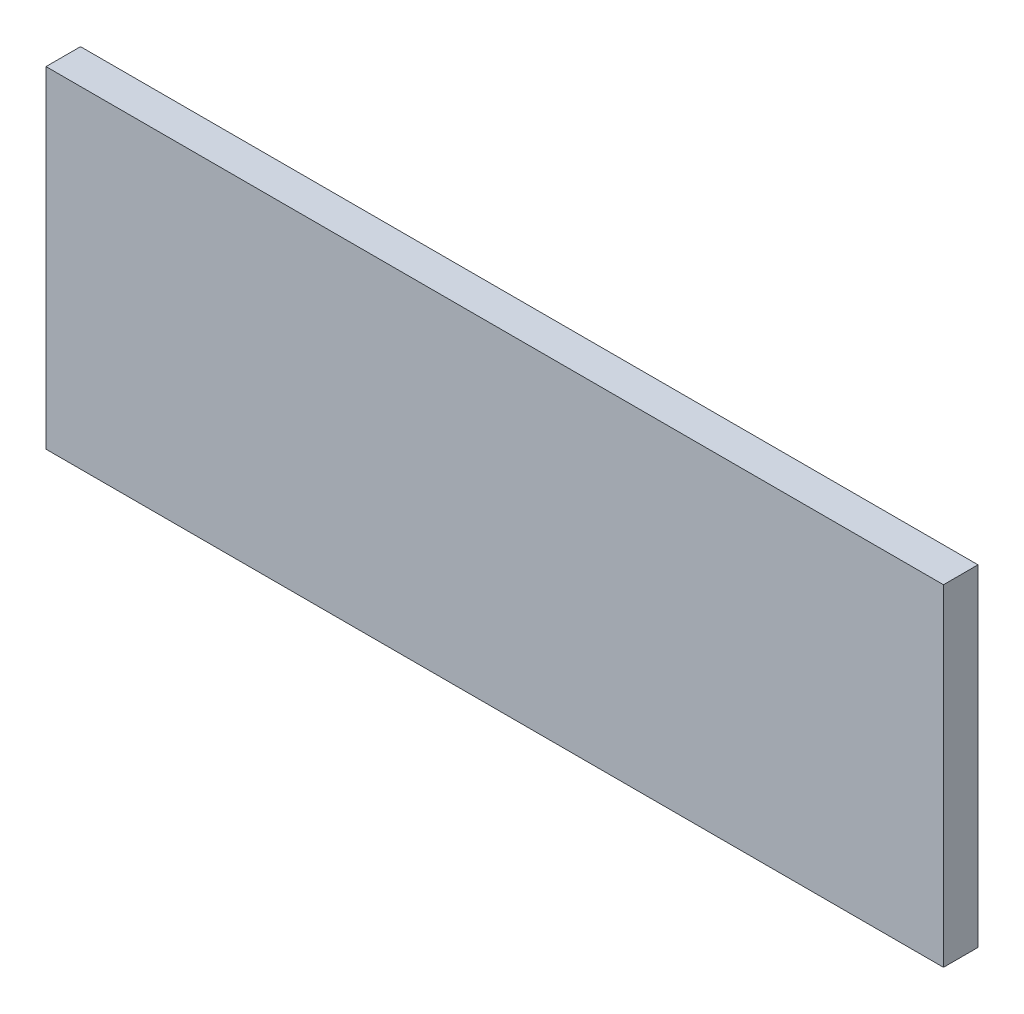
ISO-10303-21;
HEADER;
FILE_DESCRIPTION(('STEP AP214'),'2;1');
FILE_NAME('part.step','',(''),(''),'','','');
FILE_SCHEMA(('AUTOMOTIVE_DESIGN { 1 0 10303 214 1 1 1 1 }'));
ENDSEC;
DATA;
#1=APPLICATION_CONTEXT('core data for automotive mechanical design processes');
#2=APPLICATION_PROTOCOL_DEFINITION('international standard','automotive_design',2000,#1);
#3=PRODUCT_CONTEXT('',#1,'mechanical');
#4=PRODUCT('Part','Part','',(#3));
#5=PRODUCT_RELATED_PRODUCT_CATEGORY('part','',(#4));
#6=PRODUCT_DEFINITION_FORMATION('','',#4);
#7=PRODUCT_DEFINITION_CONTEXT('part definition',#1,'design');
#8=PRODUCT_DEFINITION('design','',#6,#7);
#9=PRODUCT_DEFINITION_SHAPE('','',#8);
#10=(LENGTH_UNIT() NAMED_UNIT(*) SI_UNIT(.MILLI.,.METRE.));
#11=(NAMED_UNIT(*) PLANE_ANGLE_UNIT() SI_UNIT($,.RADIAN.));
#12=(NAMED_UNIT(*) SI_UNIT($,.STERADIAN.) SOLID_ANGLE_UNIT());
#13=UNCERTAINTY_MEASURE_WITH_UNIT(LENGTH_MEASURE(1.E-05),#10,'distance_accuracy_value','');
#14=(GEOMETRIC_REPRESENTATION_CONTEXT(3) GLOBAL_UNCERTAINTY_ASSIGNED_CONTEXT((#13)) GLOBAL_UNIT_ASSIGNED_CONTEXT((#10,
#11,#12)) REPRESENTATION_CONTEXT('',''));
#15=CARTESIAN_POINT('',(0.,0.,0.));
#16=DIRECTION('',(0.,0.,1.));
#17=DIRECTION('',(1.,0.,0.));
#18=AXIS2_PLACEMENT_3D('',#15,#16,#17);
#19=CARTESIAN_POINT('',(0.,0.,1.27));
#20=DIRECTION('',(1.,0.,0.));
#21=DIRECTION('',(0.,1.,0.));
#22=AXIS2_PLACEMENT_3D('',#19,#20,#21);
#23=PLANE('',#22);
#24=DIRECTION('',(0.,-1.,0.));
#25=VECTOR('',#24,1.);
#26=CARTESIAN_POINT('',(0.,0.,0.));
#27=LINE('',#26,#25);
#28=CARTESIAN_POINT('',(0.,12.192,0.));
#29=VERTEX_POINT('',#28);
#30=CARTESIAN_POINT('',(0.,0.,0.));
#31=VERTEX_POINT('',#30);
#32=EDGE_CURVE('E107',#29,#31,#27,.T.);
#33=ORIENTED_EDGE('',*,*,#32,.T.);
#34=DIRECTION('',(0.,0.,-1.));
#35=VECTOR('',#34,1.);
#36=CARTESIAN_POINT('',(0.,0.,1.27));
#37=LINE('',#36,#35);
#38=CARTESIAN_POINT('',(0.,0.,1.27));
#39=VERTEX_POINT('',#38);
#40=EDGE_CURVE('E11',#39,#31,#37,.T.);
#41=ORIENTED_EDGE('',*,*,#40,.F.);
#42=DIRECTION('',(0.,-1.,0.));
#43=VECTOR('',#42,1.);
#44=CARTESIAN_POINT('',(0.,0.,1.27));
#45=LINE('',#44,#43);
#46=CARTESIAN_POINT('',(0.,12.192,1.27));
#47=VERTEX_POINT('',#46);
#48=EDGE_CURVE('E91',#47,#39,#45,.T.);
#49=ORIENTED_EDGE('',*,*,#48,.F.);
#50=DIRECTION('',(0.,0.,-1.));
#51=VECTOR('',#50,1.);
#52=CARTESIAN_POINT('',(0.,12.192,1.27));
#53=LINE('',#52,#51);
#54=EDGE_CURVE('E103',#47,#29,#53,.T.);
#55=ORIENTED_EDGE('',*,*,#54,.T.);
#56=EDGE_LOOP('',(#33,#41,#49,#55));
#57=FACE_BOUND('',#56,.T.);
#58=ADVANCED_FACE('F39',(#57),#23,.F.);
#59=CARTESIAN_POINT('',(0.,0.,1.27));
#60=DIRECTION('',(0.,1.,0.));
#61=DIRECTION('',(0.,0.,1.));
#62=AXIS2_PLACEMENT_3D('',#59,#60,#61);
#63=PLANE('',#62);
#64=DIRECTION('',(1.,0.,0.));
#65=VECTOR('',#64,1.);
#66=CARTESIAN_POINT('',(0.,0.,0.));
#67=LINE('',#66,#65);
#68=CARTESIAN_POINT('',(33.02,0.,0.));
#69=VERTEX_POINT('',#68);
#70=EDGE_CURVE('E96',#31,#69,#67,.T.);
#71=ORIENTED_EDGE('',*,*,#70,.T.);
#72=DIRECTION('',(0.,0.,-1.));
#73=VECTOR('',#72,1.);
#74=CARTESIAN_POINT('',(33.02,0.,1.27));
#75=LINE('',#74,#73);
#76=CARTESIAN_POINT('',(33.02,0.,1.27));
#77=VERTEX_POINT('',#76);
#78=EDGE_CURVE('E48',#77,#69,#75,.T.);
#79=ORIENTED_EDGE('',*,*,#78,.F.);
#80=DIRECTION('',(1.,0.,0.));
#81=VECTOR('',#80,1.);
#82=CARTESIAN_POINT('',(0.,0.,1.27));
#83=LINE('',#82,#81);
#84=EDGE_CURVE('E86',#39,#77,#83,.T.);
#85=ORIENTED_EDGE('',*,*,#84,.F.);
#86=ORIENTED_EDGE('',*,*,#40,.T.);
#87=EDGE_LOOP('',(#71,#79,#85,#86));
#88=FACE_BOUND('',#87,.T.);
#89=ADVANCED_FACE('F95',(#88),#63,.F.);
#90=CARTESIAN_POINT('',(33.02,0.,1.27));
#91=DIRECTION('',(-1.,0.,0.));
#92=DIRECTION('',(0.,-1.,0.));
#93=AXIS2_PLACEMENT_3D('',#90,#91,#92);
#94=PLANE('',#93);
#95=DIRECTION('',(0.,1.,0.));
#96=VECTOR('',#95,1.);
#97=CARTESIAN_POINT('',(33.02,0.,0.));
#98=LINE('',#97,#96);
#99=CARTESIAN_POINT('',(33.02,12.192,0.));
#100=VERTEX_POINT('',#99);
#101=EDGE_CURVE('E73',#69,#100,#98,.T.);
#102=ORIENTED_EDGE('',*,*,#101,.T.);
#103=DIRECTION('',(0.,0.,-1.));
#104=VECTOR('',#103,1.);
#105=CARTESIAN_POINT('',(33.02,12.192,1.27));
#106=LINE('',#105,#104);
#107=CARTESIAN_POINT('',(33.02,12.192,1.27));
#108=VERTEX_POINT('',#107);
#109=EDGE_CURVE('E98',#108,#100,#106,.T.);
#110=ORIENTED_EDGE('',*,*,#109,.F.);
#111=DIRECTION('',(0.,1.,0.));
#112=VECTOR('',#111,1.);
#113=CARTESIAN_POINT('',(33.02,0.,1.27));
#114=LINE('',#113,#112);
#115=EDGE_CURVE('E89',#77,#108,#114,.T.);
#116=ORIENTED_EDGE('',*,*,#115,.F.);
#117=ORIENTED_EDGE('',*,*,#78,.T.);
#118=EDGE_LOOP('',(#102,#110,#116,#117));
#119=FACE_BOUND('',#118,.T.);
#120=ADVANCED_FACE('F99',(#119),#94,.F.);
#121=CARTESIAN_POINT('',(0.,12.192,1.27));
#122=DIRECTION('',(0.,-1.,0.));
#123=DIRECTION('',(0.,0.,-1.));
#124=AXIS2_PLACEMENT_3D('',#121,#122,#123);
#125=PLANE('',#124);
#126=DIRECTION('',(-1.,0.,0.));
#127=VECTOR('',#126,1.);
#128=CARTESIAN_POINT('',(0.,12.192,0.));
#129=LINE('',#128,#127);
#130=EDGE_CURVE('E79',#100,#29,#129,.T.);
#131=ORIENTED_EDGE('',*,*,#130,.T.);
#132=ORIENTED_EDGE('',*,*,#54,.F.);
#133=DIRECTION('',(-1.,0.,0.));
#134=VECTOR('',#133,1.);
#135=CARTESIAN_POINT('',(0.,12.192,1.27));
#136=LINE('',#135,#134);
#137=EDGE_CURVE('E56',#108,#47,#136,.T.);
#138=ORIENTED_EDGE('',*,*,#137,.F.);
#139=ORIENTED_EDGE('',*,*,#109,.T.);
#140=EDGE_LOOP('',(#131,#132,#138,#139));
#141=FACE_BOUND('',#140,.T.);
#142=ADVANCED_FACE('F120',(#141),#125,.F.);
#143=CARTESIAN_POINT('',(0.,0.,1.27));
#144=DIRECTION('',(0.,0.,-1.));
#145=DIRECTION('',(-1.,0.,0.));
#146=AXIS2_PLACEMENT_3D('',#143,#144,#145);
#147=PLANE('',#146);
#148=ORIENTED_EDGE('',*,*,#48,.T.);
#149=ORIENTED_EDGE('',*,*,#84,.T.);
#150=ORIENTED_EDGE('',*,*,#115,.T.);
#151=ORIENTED_EDGE('',*,*,#137,.T.);
#152=EDGE_LOOP('',(#148,#149,#150,#151));
#153=FACE_BOUND('',#152,.T.);
#154=ADVANCED_FACE('F87',(#153),#147,.F.);
#155=CARTESIAN_POINT('',(0.,0.,0.));
#156=DIRECTION('',(0.,0.,-1.));
#157=DIRECTION('',(-1.,0.,0.));
#158=AXIS2_PLACEMENT_3D('',#155,#156,#157);
#159=PLANE('',#158);
#160=ORIENTED_EDGE('',*,*,#32,.F.);
#161=ORIENTED_EDGE('',*,*,#130,.F.);
#162=ORIENTED_EDGE('',*,*,#101,.F.);
#163=ORIENTED_EDGE('',*,*,#70,.F.);
#164=EDGE_LOOP('',(#160,#161,#162,#163));
#165=FACE_BOUND('',#164,.T.);
#166=ADVANCED_FACE('F123',(#165),#159,.T.);
#167=CLOSED_SHELL('',(#58,#89,#120,#142,#154,#166));
#168=MANIFOLD_SOLID_BREP('B2',#167);
#169=ADVANCED_BREP_SHAPE_REPRESENTATION('',(#18,#168),#14);
#170=SHAPE_DEFINITION_REPRESENTATION(#9,#169);
ENDSEC;
END-ISO-10303-21;
